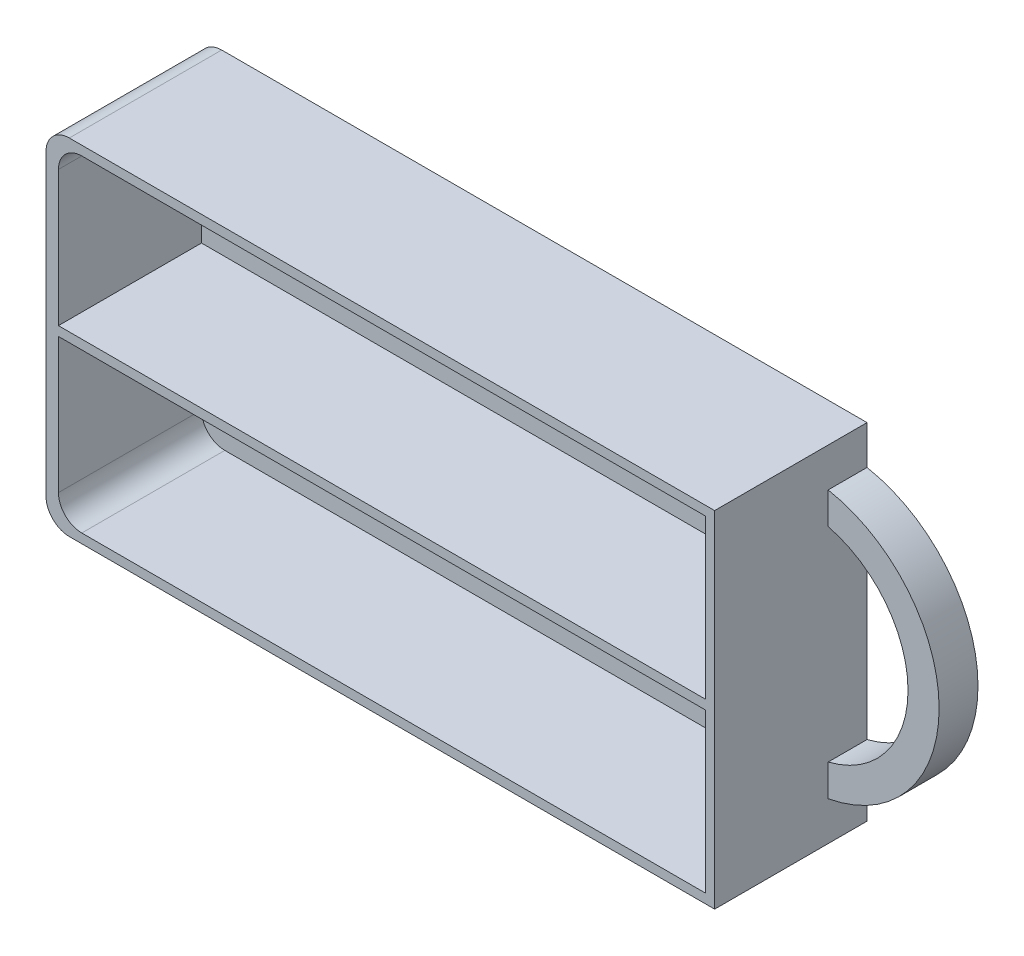
ISO-10303-21;
HEADER;
FILE_DESCRIPTION(('STEP AP214'),'2;1');
FILE_NAME('part.step','',(''),(''),'','','');
FILE_SCHEMA(('AUTOMOTIVE_DESIGN { 1 0 10303 214 1 1 1 1 }'));
ENDSEC;
DATA;
#1=APPLICATION_CONTEXT('core data for automotive mechanical design processes');
#2=APPLICATION_PROTOCOL_DEFINITION('international standard','automotive_design',2000,#1);
#3=PRODUCT_CONTEXT('',#1,'mechanical');
#4=PRODUCT('Part','Part','',(#3));
#5=PRODUCT_RELATED_PRODUCT_CATEGORY('part','',(#4));
#6=PRODUCT_DEFINITION_FORMATION('','',#4);
#7=PRODUCT_DEFINITION_CONTEXT('part definition',#1,'design');
#8=PRODUCT_DEFINITION('design','',#6,#7);
#9=PRODUCT_DEFINITION_SHAPE('','',#8);
#10=(LENGTH_UNIT() NAMED_UNIT(*) SI_UNIT(.MILLI.,.METRE.));
#11=(NAMED_UNIT(*) PLANE_ANGLE_UNIT() SI_UNIT($,.RADIAN.));
#12=(NAMED_UNIT(*) SI_UNIT($,.STERADIAN.) SOLID_ANGLE_UNIT());
#13=UNCERTAINTY_MEASURE_WITH_UNIT(LENGTH_MEASURE(1.E-05),#10,'distance_accuracy_value','');
#14=(GEOMETRIC_REPRESENTATION_CONTEXT(3) GLOBAL_UNCERTAINTY_ASSIGNED_CONTEXT((#13)) GLOBAL_UNIT_ASSIGNED_CONTEXT((#10,
#11,#12)) REPRESENTATION_CONTEXT('',''));
#15=CARTESIAN_POINT('',(0.,0.,0.));
#16=DIRECTION('',(0.,0.,1.));
#17=DIRECTION('',(1.,0.,0.));
#18=AXIS2_PLACEMENT_3D('',#15,#16,#17);
#19=CARTESIAN_POINT('',(43.,22.2,19.6));
#20=DIRECTION('',(-1.,0.,0.));
#21=DIRECTION('',(0.,-1.,0.));
#22=AXIS2_PLACEMENT_3D('',#19,#20,#21);
#23=PLANE('',#22);
#24=DIRECTION('',(0.,0.,-1.));
#25=VECTOR('',#24,1.);
#26=CARTESIAN_POINT('',(43.,-17.2,5.));
#27=LINE('',#26,#25);
#28=CARTESIAN_POINT('',(43.,-17.2,5.));
#29=VERTEX_POINT('',#28);
#30=CARTESIAN_POINT('',(43.,-17.2,0.));
#31=VERTEX_POINT('',#30);
#32=EDGE_CURVE('E256',#29,#31,#27,.T.);
#33=ORIENTED_EDGE('',*,*,#32,.F.);
#34=DIRECTION('',(0.,-1.,0.));
#35=VECTOR('',#34,1.);
#36=CARTESIAN_POINT('',(43.,-17.2,5.));
#37=LINE('',#36,#35);
#38=CARTESIAN_POINT('',(43.,-13.1087756865391,5.));
#39=VERTEX_POINT('',#38);
#40=EDGE_CURVE('E253',#39,#29,#37,.T.);
#41=ORIENTED_EDGE('',*,*,#40,.F.);
#42=DIRECTION('',(0.,0.,-1.));
#43=VECTOR('',#42,1.);
#44=CARTESIAN_POINT('',(43.,-13.1087756865391,5.));
#45=LINE('',#44,#43);
#46=CARTESIAN_POINT('',(43.,-13.1087756865391,0.));
#47=VERTEX_POINT('',#46);
#48=EDGE_CURVE('E263',#39,#47,#45,.T.);
#49=ORIENTED_EDGE('',*,*,#48,.T.);
#50=DIRECTION('',(0.,1.,0.));
#51=VECTOR('',#50,1.);
#52=CARTESIAN_POINT('',(43.,22.2,0.));
#53=LINE('',#52,#51);
#54=CARTESIAN_POINT('',(43.,13.1087756865391,0.));
#55=VERTEX_POINT('',#54);
#56=EDGE_CURVE('E289',#47,#55,#53,.T.);
#57=ORIENTED_EDGE('',*,*,#56,.T.);
#58=DIRECTION('',(0.,0.,-1.));
#59=VECTOR('',#58,1.);
#60=CARTESIAN_POINT('',(43.,13.1087756865391,5.));
#61=LINE('',#60,#59);
#62=CARTESIAN_POINT('',(43.,13.1087756865391,5.));
#63=VERTEX_POINT('',#62);
#64=EDGE_CURVE('E266',#63,#55,#61,.T.);
#65=ORIENTED_EDGE('',*,*,#64,.F.);
#66=DIRECTION('',(0.,-1.,0.));
#67=VECTOR('',#66,1.);
#68=CARTESIAN_POINT('',(43.,17.2,5.));
#69=LINE('',#68,#67);
#70=CARTESIAN_POINT('',(43.,17.2,5.));
#71=VERTEX_POINT('',#70);
#72=EDGE_CURVE('E246',#71,#63,#69,.T.);
#73=ORIENTED_EDGE('',*,*,#72,.F.);
#74=DIRECTION('',(0.,0.,-1.));
#75=VECTOR('',#74,1.);
#76=CARTESIAN_POINT('',(43.,17.2,5.));
#77=LINE('',#76,#75);
#78=CARTESIAN_POINT('',(43.,17.2,0.));
#79=VERTEX_POINT('',#78);
#80=EDGE_CURVE('E269',#71,#79,#77,.T.);
#81=ORIENTED_EDGE('',*,*,#80,.T.);
#82=CARTESIAN_POINT('',(43.,22.2,0.));
#83=VERTEX_POINT('',#82);
#84=EDGE_CURVE('E272',#79,#83,#53,.T.);
#85=ORIENTED_EDGE('',*,*,#84,.T.);
#86=DIRECTION('',(0.,0.,-1.));
#87=VECTOR('',#86,1.);
#88=CARTESIAN_POINT('',(43.,22.2,19.6));
#89=LINE('',#88,#87);
#90=CARTESIAN_POINT('',(43.,22.2,19.6));
#91=VERTEX_POINT('',#90);
#92=EDGE_CURVE('E298',#91,#83,#89,.T.);
#93=ORIENTED_EDGE('',*,*,#92,.F.);
#94=DIRECTION('',(0.,1.,0.));
#95=VECTOR('',#94,1.);
#96=CARTESIAN_POINT('',(43.,22.2,19.6));
#97=LINE('',#96,#95);
#98=CARTESIAN_POINT('',(43.,-22.2,19.6));
#99=VERTEX_POINT('',#98);
#100=EDGE_CURVE('E273',#99,#91,#97,.T.);
#101=ORIENTED_EDGE('',*,*,#100,.F.);
#102=DIRECTION('',(0.,0.,-1.));
#103=VECTOR('',#102,1.);
#104=CARTESIAN_POINT('',(43.,-22.2,19.6));
#105=LINE('',#104,#103);
#106=CARTESIAN_POINT('',(43.,-22.2,0.));
#107=VERTEX_POINT('',#106);
#108=EDGE_CURVE('E285',#99,#107,#105,.T.);
#109=ORIENTED_EDGE('',*,*,#108,.T.);
#110=EDGE_CURVE('E286',#107,#31,#53,.T.);
#111=ORIENTED_EDGE('',*,*,#110,.T.);
#112=EDGE_LOOP('',(#33,#41,#49,#57,#65,#73,#81,#85,#93,#101,#109,#111));
#113=FACE_BOUND('',#112,.T.);
#114=ADVANCED_FACE('F41',(#113),#23,.F.);
#115=CARTESIAN_POINT('',(-43.,22.2,19.6));
#116=DIRECTION('',(0.,-1.,0.));
#117=DIRECTION('',(0.,0.,-1.));
#118=AXIS2_PLACEMENT_3D('',#115,#116,#117);
#119=PLANE('',#118);
#120=DIRECTION('',(-1.,0.,0.));
#121=VECTOR('',#120,1.);
#122=CARTESIAN_POINT('',(-43.,22.2,0.));
#123=LINE('',#122,#121);
#124=CARTESIAN_POINT('',(-40.,22.2,0.));
#125=VERTEX_POINT('',#124);
#126=EDGE_CURVE('E288',#83,#125,#123,.T.);
#127=ORIENTED_EDGE('',*,*,#126,.T.);
#128=DIRECTION('',(0.,0.,-1.));
#129=VECTOR('',#128,1.);
#130=CARTESIAN_POINT('',(-40.,22.2,19.6));
#131=LINE('',#130,#129);
#132=CARTESIAN_POINT('',(-40.,22.2,19.6));
#133=VERTEX_POINT('',#132);
#134=EDGE_CURVE('E310',#125,#133,#131,.F.);
#135=ORIENTED_EDGE('',*,*,#134,.T.);
#136=DIRECTION('',(-1.,0.,0.));
#137=VECTOR('',#136,1.);
#138=CARTESIAN_POINT('',(-43.,22.2,19.6));
#139=LINE('',#138,#137);
#140=EDGE_CURVE('E276',#91,#133,#139,.T.);
#141=ORIENTED_EDGE('',*,*,#140,.F.);
#142=ORIENTED_EDGE('',*,*,#92,.T.);
#143=EDGE_LOOP('',(#127,#135,#141,#142));
#144=FACE_BOUND('',#143,.T.);
#145=ADVANCED_FACE('F368',(#144),#119,.F.);
#146=CARTESIAN_POINT('',(-43.,22.2,19.6));
#147=DIRECTION('',(1.,0.,0.));
#148=DIRECTION('',(0.,1.,0.));
#149=AXIS2_PLACEMENT_3D('',#146,#147,#148);
#150=PLANE('',#149);
#151=DIRECTION('',(0.,-1.,0.));
#152=VECTOR('',#151,1.);
#153=CARTESIAN_POINT('',(-43.,22.2,19.6));
#154=LINE('',#153,#152);
#155=CARTESIAN_POINT('',(-43.,19.2,19.6));
#156=VERTEX_POINT('',#155);
#157=CARTESIAN_POINT('',(-43.,-19.2,19.6));
#158=VERTEX_POINT('',#157);
#159=EDGE_CURVE('E280',#156,#158,#154,.T.);
#160=ORIENTED_EDGE('',*,*,#159,.F.);
#161=DIRECTION('',(0.,0.,-1.));
#162=VECTOR('',#161,1.);
#163=CARTESIAN_POINT('',(-43.,19.2,19.6));
#164=LINE('',#163,#162);
#165=CARTESIAN_POINT('',(-43.,19.2,0.));
#166=VERTEX_POINT('',#165);
#167=EDGE_CURVE('E303',#156,#166,#164,.T.);
#168=ORIENTED_EDGE('',*,*,#167,.T.);
#169=DIRECTION('',(0.,-1.,0.));
#170=VECTOR('',#169,1.);
#171=CARTESIAN_POINT('',(-43.,22.2,0.));
#172=LINE('',#171,#170);
#173=CARTESIAN_POINT('',(-43.,-19.2,0.));
#174=VERTEX_POINT('',#173);
#175=EDGE_CURVE('E292',#166,#174,#172,.T.);
#176=ORIENTED_EDGE('',*,*,#175,.T.);
#177=DIRECTION('',(0.,0.,-1.));
#178=VECTOR('',#177,1.);
#179=CARTESIAN_POINT('',(-43.,-19.2,19.6));
#180=LINE('',#179,#178);
#181=EDGE_CURVE('E301',#174,#158,#180,.F.);
#182=ORIENTED_EDGE('',*,*,#181,.T.);
#183=EDGE_LOOP('',(#160,#168,#176,#182));
#184=FACE_BOUND('',#183,.T.);
#185=ADVANCED_FACE('F374',(#184),#150,.F.);
#186=CARTESIAN_POINT('',(-43.,-22.2,19.6));
#187=DIRECTION('',(0.,1.,0.));
#188=DIRECTION('',(0.,0.,1.));
#189=AXIS2_PLACEMENT_3D('',#186,#187,#188);
#190=PLANE('',#189);
#191=DIRECTION('',(1.,0.,0.));
#192=VECTOR('',#191,1.);
#193=CARTESIAN_POINT('',(-43.,-22.2,19.6));
#194=LINE('',#193,#192);
#195=CARTESIAN_POINT('',(-40.,-22.2,19.6));
#196=VERTEX_POINT('',#195);
#197=EDGE_CURVE('E283',#196,#99,#194,.T.);
#198=ORIENTED_EDGE('',*,*,#197,.F.);
#199=DIRECTION('',(0.,0.,-1.));
#200=VECTOR('',#199,1.);
#201=CARTESIAN_POINT('',(-40.,-22.2,19.6));
#202=LINE('',#201,#200);
#203=CARTESIAN_POINT('',(-40.,-22.2,0.));
#204=VERTEX_POINT('',#203);
#205=EDGE_CURVE('E316',#196,#204,#202,.T.);
#206=ORIENTED_EDGE('',*,*,#205,.T.);
#207=DIRECTION('',(1.,0.,0.));
#208=VECTOR('',#207,1.);
#209=CARTESIAN_POINT('',(-43.,-22.2,0.));
#210=LINE('',#209,#208);
#211=EDGE_CURVE('E277',#204,#107,#210,.T.);
#212=ORIENTED_EDGE('',*,*,#211,.T.);
#213=ORIENTED_EDGE('',*,*,#108,.F.);
#214=EDGE_LOOP('',(#198,#206,#212,#213));
#215=FACE_BOUND('',#214,.T.);
#216=ADVANCED_FACE('F562',(#215),#190,.F.);
#217=CARTESIAN_POINT('',(0.,0.,19.6));
#218=DIRECTION('',(0.,0.,1.));
#219=DIRECTION('',(1.,0.,0.));
#220=AXIS2_PLACEMENT_3D('',#217,#218,#219);
#221=PLANE('',#220);
#222=DIRECTION('',(-1.,0.,0.));
#223=VECTOR('',#222,1.);
#224=CARTESIAN_POINT('',(0.,21.,19.6));
#225=LINE('',#224,#223);
#226=CARTESIAN_POINT('',(41.8,21.,19.6));
#227=VERTEX_POINT('',#226);
#228=CARTESIAN_POINT('',(-38.4,21.,19.6));
#229=VERTEX_POINT('',#228);
#230=EDGE_CURVE('E189',#227,#229,#225,.T.);
#231=ORIENTED_EDGE('',*,*,#230,.F.);
#232=DIRECTION('',(0.,1.,0.));
#233=VECTOR('',#232,1.);
#234=CARTESIAN_POINT('',(41.8,0.,19.6));
#235=LINE('',#234,#233);
#236=CARTESIAN_POINT('',(41.8,0.597115384615389,19.6));
#237=VERTEX_POINT('',#236);
#238=EDGE_CURVE('E199',#237,#227,#235,.T.);
#239=ORIENTED_EDGE('',*,*,#238,.F.);
#240=DIRECTION('',(-1.,0.,0.));
#241=VECTOR('',#240,1.);
#242=CARTESIAN_POINT('',(0.,0.597115384615384,19.6));
#243=LINE('',#242,#241);
#244=CARTESIAN_POINT('',(-41.4,0.597115384615379,19.6));
#245=VERTEX_POINT('',#244);
#246=EDGE_CURVE('E188',#237,#245,#243,.T.);
#247=ORIENTED_EDGE('',*,*,#246,.T.);
#248=DIRECTION('',(0.,-1.,0.));
#249=VECTOR('',#248,1.);
#250=CARTESIAN_POINT('',(-41.4,0.,19.6));
#251=LINE('',#250,#249);
#252=CARTESIAN_POINT('',(-41.4,18.,19.6));
#253=VERTEX_POINT('',#252);
#254=EDGE_CURVE('E180',#253,#245,#251,.T.);
#255=ORIENTED_EDGE('',*,*,#254,.F.);
#256=CARTESIAN_POINT('',(-38.4,18.,19.6));
#257=DIRECTION('',(0.,0.,1.));
#258=DIRECTION('',(1.,0.,0.));
#259=AXIS2_PLACEMENT_3D('',#256,#257,#258);
#260=CIRCLE('',#259,3.);
#261=EDGE_CURVE('E12',#253,#229,#260,.F.);
#262=ORIENTED_EDGE('',*,*,#261,.T.);
#263=EDGE_LOOP('',(#231,#239,#247,#255,#262));
#264=FACE_BOUND('',#263,.T.);
#265=DIRECTION('',(-1.,0.,0.));
#266=VECTOR('',#265,1.);
#267=CARTESIAN_POINT('',(0.,-0.602884615384616,19.6));
#268=LINE('',#267,#266);
#269=CARTESIAN_POINT('',(41.8,-0.60288461538461,19.6));
#270=VERTEX_POINT('',#269);
#271=CARTESIAN_POINT('',(-41.4,-0.602884615384621,19.6));
#272=VERTEX_POINT('',#271);
#273=EDGE_CURVE('E225',#270,#272,#268,.T.);
#274=ORIENTED_EDGE('',*,*,#273,.F.);
#275=DIRECTION('',(0.,1.,0.));
#276=VECTOR('',#275,1.);
#277=CARTESIAN_POINT('',(41.8,0.,19.6));
#278=LINE('',#277,#276);
#279=CARTESIAN_POINT('',(41.8,-21.,19.6));
#280=VERTEX_POINT('',#279);
#281=EDGE_CURVE('E232',#280,#270,#278,.T.);
#282=ORIENTED_EDGE('',*,*,#281,.F.);
#283=DIRECTION('',(1.,0.,0.));
#284=VECTOR('',#283,1.);
#285=CARTESIAN_POINT('',(0.,-21.,19.6));
#286=LINE('',#285,#284);
#287=CARTESIAN_POINT('',(-38.4,-21.,19.6));
#288=VERTEX_POINT('',#287);
#289=EDGE_CURVE('E230',#288,#280,#286,.T.);
#290=ORIENTED_EDGE('',*,*,#289,.F.);
#291=CARTESIAN_POINT('',(-38.4,-18.,19.6));
#292=DIRECTION('',(0.,0.,1.));
#293=DIRECTION('',(1.,0.,0.));
#294=AXIS2_PLACEMENT_3D('',#291,#292,#293);
#295=CIRCLE('',#294,3.);
#296=CARTESIAN_POINT('',(-41.4,-18.,19.6));
#297=VERTEX_POINT('',#296);
#298=EDGE_CURVE('E49',#288,#297,#295,.F.);
#299=ORIENTED_EDGE('',*,*,#298,.T.);
#300=DIRECTION('',(0.,-1.,0.));
#301=VECTOR('',#300,1.);
#302=CARTESIAN_POINT('',(-41.4,0.,19.6));
#303=LINE('',#302,#301);
#304=EDGE_CURVE('E227',#272,#297,#303,.T.);
#305=ORIENTED_EDGE('',*,*,#304,.F.);
#306=EDGE_LOOP('',(#274,#282,#290,#299,#305));
#307=FACE_BOUND('',#306,.T.);
#308=ORIENTED_EDGE('',*,*,#140,.T.);
#309=CARTESIAN_POINT('',(-40.,19.2,19.6));
#310=DIRECTION('',(0.,0.,1.));
#311=DIRECTION('',(1.,0.,0.));
#312=AXIS2_PLACEMENT_3D('',#309,#310,#311);
#313=CIRCLE('',#312,3.);
#314=EDGE_CURVE('E314',#133,#156,#313,.T.);
#315=ORIENTED_EDGE('',*,*,#314,.T.);
#316=ORIENTED_EDGE('',*,*,#159,.T.);
#317=CARTESIAN_POINT('',(-40.,-19.2,19.6));
#318=DIRECTION('',(0.,0.,1.));
#319=DIRECTION('',(1.,0.,0.));
#320=AXIS2_PLACEMENT_3D('',#317,#318,#319);
#321=CIRCLE('',#320,3.);
#322=EDGE_CURVE('E312',#158,#196,#321,.T.);
#323=ORIENTED_EDGE('',*,*,#322,.T.);
#324=ORIENTED_EDGE('',*,*,#197,.T.);
#325=ORIENTED_EDGE('',*,*,#100,.T.);
#326=EDGE_LOOP('',(#308,#315,#316,#323,#324,#325));
#327=FACE_BOUND('',#326,.T.);
#328=ADVANCED_FACE('F202',(#264,#307,#327),#221,.T.);
#329=CARTESIAN_POINT('',(0.,0.,0.));
#330=DIRECTION('',(0.,0.,1.));
#331=DIRECTION('',(1.,0.,0.));
#332=AXIS2_PLACEMENT_3D('',#329,#330,#331);
#333=PLANE('',#332);
#334=CARTESIAN_POINT('',(39.7735468390197,0.,0.));
#335=DIRECTION('',(0.,0.,-1.));
#336=DIRECTION('',(1.,0.,0.));
#337=AXIS2_PLACEMENT_3D('',#334,#335,#336);
#338=CIRCLE('',#337,13.5);
#339=EDGE_CURVE('E247',#55,#47,#338,.T.);
#340=ORIENTED_EDGE('',*,*,#339,.F.);
#341=ORIENTED_EDGE('',*,*,#56,.F.);
#342=EDGE_LOOP('',(#340,#341));
#343=FACE_BOUND('',#342,.T.);
#344=ORIENTED_EDGE('',*,*,#175,.F.);
#345=CARTESIAN_POINT('',(-40.,19.2,0.));
#346=DIRECTION('',(0.,0.,1.));
#347=DIRECTION('',(1.,0.,0.));
#348=AXIS2_PLACEMENT_3D('',#345,#346,#347);
#349=CIRCLE('',#348,3.);
#350=EDGE_CURVE('E308',#166,#125,#349,.F.);
#351=ORIENTED_EDGE('',*,*,#350,.T.);
#352=ORIENTED_EDGE('',*,*,#126,.F.);
#353=ORIENTED_EDGE('',*,*,#84,.F.);
#354=CARTESIAN_POINT('',(39.7735468390197,0.,0.));
#355=DIRECTION('',(0.,0.,1.));
#356=DIRECTION('',(1.,0.,0.));
#357=AXIS2_PLACEMENT_3D('',#354,#355,#356);
#358=CIRCLE('',#357,17.5);
#359=EDGE_CURVE('E214',#31,#79,#358,.T.);
#360=ORIENTED_EDGE('',*,*,#359,.F.);
#361=ORIENTED_EDGE('',*,*,#110,.F.);
#362=ORIENTED_EDGE('',*,*,#211,.F.);
#363=CARTESIAN_POINT('',(-40.,-19.2,0.));
#364=DIRECTION('',(0.,0.,1.));
#365=DIRECTION('',(1.,0.,0.));
#366=AXIS2_PLACEMENT_3D('',#363,#364,#365);
#367=CIRCLE('',#366,3.);
#368=EDGE_CURVE('E306',#204,#174,#367,.F.);
#369=ORIENTED_EDGE('',*,*,#368,.T.);
#370=EDGE_LOOP('',(#344,#351,#352,#353,#360,#361,#362,#369));
#371=FACE_BOUND('',#370,.T.);
#372=ADVANCED_FACE('F538',(#343,#371),#333,.F.);
#373=CARTESIAN_POINT('',(39.7735468390197,0.,5.));
#374=DIRECTION('',(0.,0.,-1.));
#375=DIRECTION('',(-1.,0.,0.));
#376=AXIS2_PLACEMENT_3D('',#373,#374,#375);
#377=CYLINDRICAL_SURFACE('',#376,17.5);
#378=ORIENTED_EDGE('',*,*,#359,.T.);
#379=ORIENTED_EDGE('',*,*,#80,.F.);
#380=CARTESIAN_POINT('',(39.7735468390197,0.,5.));
#381=DIRECTION('',(0.,0.,1.));
#382=DIRECTION('',(1.,0.,0.));
#383=AXIS2_PLACEMENT_3D('',#380,#381,#382);
#384=CIRCLE('',#383,17.5);
#385=EDGE_CURVE('E243',#29,#71,#384,.T.);
#386=ORIENTED_EDGE('',*,*,#385,.F.);
#387=ORIENTED_EDGE('',*,*,#32,.T.);
#388=EDGE_LOOP('',(#378,#379,#386,#387));
#389=FACE_BOUND('',#388,.T.);
#390=ADVANCED_FACE('F528',(#389),#377,.T.);
#391=CARTESIAN_POINT('',(39.7735468390197,0.,5.));
#392=DIRECTION('',(0.,0.,-1.));
#393=DIRECTION('',(-1.,0.,0.));
#394=AXIS2_PLACEMENT_3D('',#391,#392,#393);
#395=CYLINDRICAL_SURFACE('',#394,13.5);
#396=ORIENTED_EDGE('',*,*,#339,.T.);
#397=ORIENTED_EDGE('',*,*,#48,.F.);
#398=CARTESIAN_POINT('',(39.7735468390197,0.,5.));
#399=DIRECTION('',(0.,0.,-1.));
#400=DIRECTION('',(1.,0.,0.));
#401=AXIS2_PLACEMENT_3D('',#398,#399,#400);
#402=CIRCLE('',#401,13.5);
#403=EDGE_CURVE('E250',#63,#39,#402,.T.);
#404=ORIENTED_EDGE('',*,*,#403,.F.);
#405=ORIENTED_EDGE('',*,*,#64,.T.);
#406=EDGE_LOOP('',(#396,#397,#404,#405));
#407=FACE_BOUND('',#406,.T.);
#408=ADVANCED_FACE('F363',(#407),#395,.F.);
#409=CARTESIAN_POINT('',(39.7735468390197,0.,5.));
#410=DIRECTION('',(0.,0.,1.));
#411=DIRECTION('',(1.,0.,0.));
#412=AXIS2_PLACEMENT_3D('',#409,#410,#411);
#413=PLANE('',#412);
#414=ORIENTED_EDGE('',*,*,#385,.T.);
#415=ORIENTED_EDGE('',*,*,#72,.T.);
#416=ORIENTED_EDGE('',*,*,#403,.T.);
#417=ORIENTED_EDGE('',*,*,#40,.T.);
#418=EDGE_LOOP('',(#414,#415,#416,#417));
#419=FACE_BOUND('',#418,.T.);
#420=ADVANCED_FACE('F356',(#419),#413,.T.);
#421=CARTESIAN_POINT('',(0.,-0.602884615384616,-85.6651486932037));
#422=DIRECTION('',(0.,1.,0.));
#423=DIRECTION('',(-1.,0.,0.));
#424=AXIS2_PLACEMENT_3D('',#421,#422,#423);
#425=PLANE('',#424);
#426=DIRECTION('',(1.,0.,0.));
#427=VECTOR('',#426,1.);
#428=CARTESIAN_POINT('',(0.,-0.602884615384616,1.20000000000001));
#429=LINE('',#428,#427);
#430=CARTESIAN_POINT('',(-41.4,-0.602884615384621,1.20000000000001));
#431=VERTEX_POINT('',#430);
#432=CARTESIAN_POINT('',(41.8,-0.60288461538461,1.20000000000001));
#433=VERTEX_POINT('',#432);
#434=EDGE_CURVE('E222',#431,#433,#429,.T.);
#435=ORIENTED_EDGE('',*,*,#434,.T.);
#436=DIRECTION('',(0.,0.,1.));
#437=VECTOR('',#436,1.);
#438=CARTESIAN_POINT('',(41.8,-0.60288461538461,-85.6651486932037));
#439=LINE('',#438,#437);
#440=EDGE_CURVE('E220',#433,#270,#439,.T.);
#441=ORIENTED_EDGE('',*,*,#440,.T.);
#442=ORIENTED_EDGE('',*,*,#273,.T.);
#443=DIRECTION('',(0.,0.,1.));
#444=VECTOR('',#443,1.);
#445=CARTESIAN_POINT('',(-41.4,-0.602884615384621,-85.6651486932037));
#446=LINE('',#445,#444);
#447=EDGE_CURVE('E235',#431,#272,#446,.T.);
#448=ORIENTED_EDGE('',*,*,#447,.F.);
#449=EDGE_LOOP('',(#435,#441,#442,#448));
#450=FACE_BOUND('',#449,.T.);
#451=ADVANCED_FACE('F354',(#450),#425,.F.);
#452=CARTESIAN_POINT('',(41.8,0.,-85.6651486932037));
#453=DIRECTION('',(1.,0.,0.));
#454=DIRECTION('',(0.,1.,0.));
#455=AXIS2_PLACEMENT_3D('',#452,#453,#454);
#456=PLANE('',#455);
#457=DIRECTION('',(0.,-1.,0.));
#458=VECTOR('',#457,1.);
#459=CARTESIAN_POINT('',(41.8,0.,1.20000000000001));
#460=LINE('',#459,#458);
#461=CARTESIAN_POINT('',(41.8,-21.,1.20000000000001));
#462=VERTEX_POINT('',#461);
#463=EDGE_CURVE('E219',#433,#462,#460,.T.);
#464=ORIENTED_EDGE('',*,*,#463,.T.);
#465=DIRECTION('',(0.,0.,1.));
#466=VECTOR('',#465,1.);
#467=CARTESIAN_POINT('',(41.8,-21.,-85.6651486932037));
#468=LINE('',#467,#466);
#469=EDGE_CURVE('E237',#462,#280,#468,.T.);
#470=ORIENTED_EDGE('',*,*,#469,.T.);
#471=ORIENTED_EDGE('',*,*,#281,.T.);
#472=ORIENTED_EDGE('',*,*,#440,.F.);
#473=EDGE_LOOP('',(#464,#470,#471,#472));
#474=FACE_BOUND('',#473,.T.);
#475=ADVANCED_FACE('F351',(#474),#456,.F.);
#476=CARTESIAN_POINT('',(0.,-21.,-85.6651486932037));
#477=DIRECTION('',(0.,-1.,0.));
#478=DIRECTION('',(0.,0.,-1.));
#479=AXIS2_PLACEMENT_3D('',#476,#477,#478);
#480=PLANE('',#479);
#481=DIRECTION('',(-1.,0.,0.));
#482=VECTOR('',#481,1.);
#483=CARTESIAN_POINT('',(0.,-21.,1.20000000000001));
#484=LINE('',#483,#482);
#485=CARTESIAN_POINT('',(-38.4,-21.,1.20000000000001));
#486=VERTEX_POINT('',#485);
#487=EDGE_CURVE('E216',#462,#486,#484,.T.);
#488=ORIENTED_EDGE('',*,*,#487,.T.);
#489=DIRECTION('',(0.,0.,1.));
#490=VECTOR('',#489,1.);
#491=CARTESIAN_POINT('',(-38.4,-21.,19.6));
#492=LINE('',#491,#490);
#493=EDGE_CURVE('E319',#486,#288,#492,.T.);
#494=ORIENTED_EDGE('',*,*,#493,.T.);
#495=ORIENTED_EDGE('',*,*,#289,.T.);
#496=ORIENTED_EDGE('',*,*,#469,.F.);
#497=EDGE_LOOP('',(#488,#494,#495,#496));
#498=FACE_BOUND('',#497,.T.);
#499=ADVANCED_FACE('F349',(#498),#480,.F.);
#500=CARTESIAN_POINT('',(-41.4,0.,-85.6651486932037));
#501=DIRECTION('',(-1.,0.,0.));
#502=DIRECTION('',(0.,-1.,0.));
#503=AXIS2_PLACEMENT_3D('',#500,#501,#502);
#504=PLANE('',#503);
#505=ORIENTED_EDGE('',*,*,#304,.T.);
#506=DIRECTION('',(0.,0.,1.));
#507=VECTOR('',#506,1.);
#508=CARTESIAN_POINT('',(-41.4,-18.,1.20000000000001));
#509=LINE('',#508,#507);
#510=CARTESIAN_POINT('',(-41.4,-18.,1.20000000000001));
#511=VERTEX_POINT('',#510);
#512=EDGE_CURVE('E322',#297,#511,#509,.F.);
#513=ORIENTED_EDGE('',*,*,#512,.T.);
#514=DIRECTION('',(0.,1.,0.));
#515=VECTOR('',#514,1.);
#516=CARTESIAN_POINT('',(-41.4,0.,1.20000000000001));
#517=LINE('',#516,#515);
#518=EDGE_CURVE('E224',#511,#431,#517,.T.);
#519=ORIENTED_EDGE('',*,*,#518,.T.);
#520=ORIENTED_EDGE('',*,*,#447,.T.);
#521=EDGE_LOOP('',(#505,#513,#519,#520));
#522=FACE_BOUND('',#521,.T.);
#523=ADVANCED_FACE('F337',(#522),#504,.F.);
#524=CARTESIAN_POINT('',(0.,0.,1.2));
#525=DIRECTION('',(0.,0.,1.));
#526=DIRECTION('',(1.,0.,0.));
#527=AXIS2_PLACEMENT_3D('',#524,#525,#526);
#528=PLANE('',#527);
#529=ORIENTED_EDGE('',*,*,#518,.F.);
#530=CARTESIAN_POINT('',(-38.4,-18.,1.20000000000001));
#531=DIRECTION('',(0.,0.,1.));
#532=DIRECTION('',(1.,0.,0.));
#533=AXIS2_PLACEMENT_3D('',#530,#531,#532);
#534=CIRCLE('',#533,3.);
#535=EDGE_CURVE('E324',#511,#486,#534,.T.);
#536=ORIENTED_EDGE('',*,*,#535,.T.);
#537=ORIENTED_EDGE('',*,*,#487,.F.);
#538=ORIENTED_EDGE('',*,*,#463,.F.);
#539=ORIENTED_EDGE('',*,*,#434,.F.);
#540=EDGE_LOOP('',(#529,#536,#537,#538,#539));
#541=FACE_BOUND('',#540,.T.);
#542=ADVANCED_FACE('F344',(#541),#528,.T.);
#543=CARTESIAN_POINT('',(0.,21.,-85.6651486932037));
#544=DIRECTION('',(0.,1.,0.));
#545=DIRECTION('',(0.,0.,1.));
#546=AXIS2_PLACEMENT_3D('',#543,#544,#545);
#547=PLANE('',#546);
#548=ORIENTED_EDGE('',*,*,#230,.T.);
#549=DIRECTION('',(0.,0.,1.));
#550=VECTOR('',#549,1.);
#551=CARTESIAN_POINT('',(-38.4,21.,1.20000000000001));
#552=LINE('',#551,#550);
#553=CARTESIAN_POINT('',(-38.4,21.,1.20000000000001));
#554=VERTEX_POINT('',#553);
#555=EDGE_CURVE('E56',#229,#554,#552,.F.);
#556=ORIENTED_EDGE('',*,*,#555,.T.);
#557=DIRECTION('',(1.,0.,0.));
#558=VECTOR('',#557,1.);
#559=CARTESIAN_POINT('',(0.,21.,1.20000000000001));
#560=LINE('',#559,#558);
#561=CARTESIAN_POINT('',(41.8,21.,1.20000000000001));
#562=VERTEX_POINT('',#561);
#563=EDGE_CURVE('E215',#554,#562,#560,.T.);
#564=ORIENTED_EDGE('',*,*,#563,.T.);
#565=DIRECTION('',(0.,0.,1.));
#566=VECTOR('',#565,1.);
#567=CARTESIAN_POINT('',(41.8,21.,-85.6651486932037));
#568=LINE('',#567,#566);
#569=EDGE_CURVE('E209',#562,#227,#568,.T.);
#570=ORIENTED_EDGE('',*,*,#569,.T.);
#571=EDGE_LOOP('',(#548,#556,#564,#570));
#572=FACE_BOUND('',#571,.T.);
#573=ADVANCED_FACE('F394',(#572),#547,.F.);
#574=CARTESIAN_POINT('',(41.8,0.,-85.6651486932037));
#575=DIRECTION('',(1.,0.,0.));
#576=DIRECTION('',(0.,1.,0.));
#577=AXIS2_PLACEMENT_3D('',#574,#575,#576);
#578=PLANE('',#577);
#579=DIRECTION('',(0.,-1.,0.));
#580=VECTOR('',#579,1.);
#581=CARTESIAN_POINT('',(41.8,0.,1.20000000000001));
#582=LINE('',#581,#580);
#583=CARTESIAN_POINT('',(41.8,0.597115384615389,1.20000000000001));
#584=VERTEX_POINT('',#583);
#585=EDGE_CURVE('E398',#562,#584,#582,.T.);
#586=ORIENTED_EDGE('',*,*,#585,.T.);
#587=DIRECTION('',(0.,0.,1.));
#588=VECTOR('',#587,1.);
#589=CARTESIAN_POINT('',(41.8,0.597115384615389,-85.6651486932037));
#590=LINE('',#589,#588);
#591=EDGE_CURVE('E198',#584,#237,#590,.T.);
#592=ORIENTED_EDGE('',*,*,#591,.T.);
#593=ORIENTED_EDGE('',*,*,#238,.T.);
#594=ORIENTED_EDGE('',*,*,#569,.F.);
#595=EDGE_LOOP('',(#586,#592,#593,#594));
#596=FACE_BOUND('',#595,.T.);
#597=ADVANCED_FACE('F402',(#596),#578,.F.);
#598=CARTESIAN_POINT('',(0.,0.597115384615384,-85.6651486932037));
#599=DIRECTION('',(0.,1.,0.));
#600=DIRECTION('',(-1.,0.,0.));
#601=AXIS2_PLACEMENT_3D('',#598,#599,#600);
#602=PLANE('',#601);
#603=DIRECTION('',(0.,0.,1.));
#604=VECTOR('',#603,1.);
#605=CARTESIAN_POINT('',(-41.4,0.597115384615379,-85.6651486932037));
#606=LINE('',#605,#604);
#607=CARTESIAN_POINT('',(-41.4,0.597115384615379,1.20000000000001));
#608=VERTEX_POINT('',#607);
#609=EDGE_CURVE('E183',#608,#245,#606,.T.);
#610=ORIENTED_EDGE('',*,*,#609,.T.);
#611=ORIENTED_EDGE('',*,*,#246,.F.);
#612=ORIENTED_EDGE('',*,*,#591,.F.);
#613=DIRECTION('',(1.,0.,0.));
#614=VECTOR('',#613,1.);
#615=CARTESIAN_POINT('',(0.,0.597115384615384,1.20000000000001));
#616=LINE('',#615,#614);
#617=EDGE_CURVE('E197',#608,#584,#616,.T.);
#618=ORIENTED_EDGE('',*,*,#617,.F.);
#619=EDGE_LOOP('',(#610,#611,#612,#618));
#620=FACE_BOUND('',#619,.T.);
#621=ADVANCED_FACE('F193',(#620),#602,.T.);
#622=CARTESIAN_POINT('',(-41.4,0.,-85.6651486932037));
#623=DIRECTION('',(-1.,0.,0.));
#624=DIRECTION('',(0.,-1.,0.));
#625=AXIS2_PLACEMENT_3D('',#622,#623,#624);
#626=PLANE('',#625);
#627=DIRECTION('',(0.,1.,0.));
#628=VECTOR('',#627,1.);
#629=CARTESIAN_POINT('',(-41.4,0.,1.20000000000001));
#630=LINE('',#629,#628);
#631=CARTESIAN_POINT('',(-41.4,18.,1.20000000000001));
#632=VERTEX_POINT('',#631);
#633=EDGE_CURVE('E212',#608,#632,#630,.T.);
#634=ORIENTED_EDGE('',*,*,#633,.T.);
#635=DIRECTION('',(0.,0.,1.));
#636=VECTOR('',#635,1.);
#637=CARTESIAN_POINT('',(-41.4,18.,19.6));
#638=LINE('',#637,#636);
#639=EDGE_CURVE('E185',#632,#253,#638,.T.);
#640=ORIENTED_EDGE('',*,*,#639,.T.);
#641=ORIENTED_EDGE('',*,*,#254,.T.);
#642=ORIENTED_EDGE('',*,*,#609,.F.);
#643=EDGE_LOOP('',(#634,#640,#641,#642));
#644=FACE_BOUND('',#643,.T.);
#645=ADVANCED_FACE('F182',(#644),#626,.F.);
#646=CARTESIAN_POINT('',(0.,0.,1.2));
#647=DIRECTION('',(0.,0.,1.));
#648=DIRECTION('',(1.,0.,0.));
#649=AXIS2_PLACEMENT_3D('',#646,#647,#648);
#650=PLANE('',#649);
#651=ORIENTED_EDGE('',*,*,#563,.F.);
#652=CARTESIAN_POINT('',(-38.4,18.,1.20000000000001));
#653=DIRECTION('',(0.,0.,1.));
#654=DIRECTION('',(1.,0.,0.));
#655=AXIS2_PLACEMENT_3D('',#652,#653,#654);
#656=CIRCLE('',#655,3.);
#657=EDGE_CURVE('E63',#554,#632,#656,.T.);
#658=ORIENTED_EDGE('',*,*,#657,.T.);
#659=ORIENTED_EDGE('',*,*,#633,.F.);
#660=ORIENTED_EDGE('',*,*,#617,.T.);
#661=ORIENTED_EDGE('',*,*,#585,.F.);
#662=EDGE_LOOP('',(#651,#658,#659,#660,#661));
#663=FACE_BOUND('',#662,.T.);
#664=ADVANCED_FACE('F383',(#663),#650,.T.);
#665=CARTESIAN_POINT('',(-40.,19.2,19.6));
#666=DIRECTION('',(0.,0.,-1.));
#667=DIRECTION('',(-1.,0.,0.));
#668=AXIS2_PLACEMENT_3D('',#665,#666,#667);
#669=CYLINDRICAL_SURFACE('',#668,3.);
#670=ORIENTED_EDGE('',*,*,#314,.F.);
#671=ORIENTED_EDGE('',*,*,#134,.F.);
#672=ORIENTED_EDGE('',*,*,#350,.F.);
#673=ORIENTED_EDGE('',*,*,#167,.F.);
#674=EDGE_LOOP('',(#670,#671,#672,#673));
#675=FACE_BOUND('',#674,.T.);
#676=ADVANCED_FACE('F379',(#675),#669,.T.);
#677=CARTESIAN_POINT('',(-40.,-19.2,19.6));
#678=DIRECTION('',(0.,0.,-1.));
#679=DIRECTION('',(-1.,0.,0.));
#680=AXIS2_PLACEMENT_3D('',#677,#678,#679);
#681=CYLINDRICAL_SURFACE('',#680,3.);
#682=ORIENTED_EDGE('',*,*,#322,.F.);
#683=ORIENTED_EDGE('',*,*,#181,.F.);
#684=ORIENTED_EDGE('',*,*,#368,.F.);
#685=ORIENTED_EDGE('',*,*,#205,.F.);
#686=EDGE_LOOP('',(#682,#683,#684,#685));
#687=FACE_BOUND('',#686,.T.);
#688=ADVANCED_FACE('F382',(#687),#681,.T.);
#689=CARTESIAN_POINT('',(-38.4,-18.,-85.6651486932037));
#690=DIRECTION('',(0.,0.,-1.));
#691=DIRECTION('',(-1.,0.,0.));
#692=AXIS2_PLACEMENT_3D('',#689,#690,#691);
#693=CYLINDRICAL_SURFACE('',#692,3.);
#694=ORIENTED_EDGE('',*,*,#535,.F.);
#695=ORIENTED_EDGE('',*,*,#512,.F.);
#696=ORIENTED_EDGE('',*,*,#298,.F.);
#697=ORIENTED_EDGE('',*,*,#493,.F.);
#698=EDGE_LOOP('',(#694,#695,#696,#697));
#699=FACE_BOUND('',#698,.T.);
#700=ADVANCED_FACE('F341',(#699),#693,.F.);
#701=CARTESIAN_POINT('',(-38.4,18.,-85.6651486932037));
#702=DIRECTION('',(0.,0.,-1.));
#703=DIRECTION('',(-1.,0.,0.));
#704=AXIS2_PLACEMENT_3D('',#701,#702,#703);
#705=CYLINDRICAL_SURFACE('',#704,3.);
#706=ORIENTED_EDGE('',*,*,#657,.F.);
#707=ORIENTED_EDGE('',*,*,#555,.F.);
#708=ORIENTED_EDGE('',*,*,#261,.F.);
#709=ORIENTED_EDGE('',*,*,#639,.F.);
#710=EDGE_LOOP('',(#706,#707,#708,#709));
#711=FACE_BOUND('',#710,.T.);
#712=ADVANCED_FACE('F43',(#711),#705,.F.);
#713=CLOSED_SHELL('',(#114,#145,#185,#216,#328,#372,#390,#408,#420,#451,#475,#499,#523,#542,
#573,#597,#621,#645,#664,#676,#688,#700,#712));
#714=MANIFOLD_SOLID_BREP('B2',#713);
#715=ADVANCED_BREP_SHAPE_REPRESENTATION('',(#18,#714),#14);
#716=SHAPE_DEFINITION_REPRESENTATION(#9,#715);
ENDSEC;
END-ISO-10303-21;
